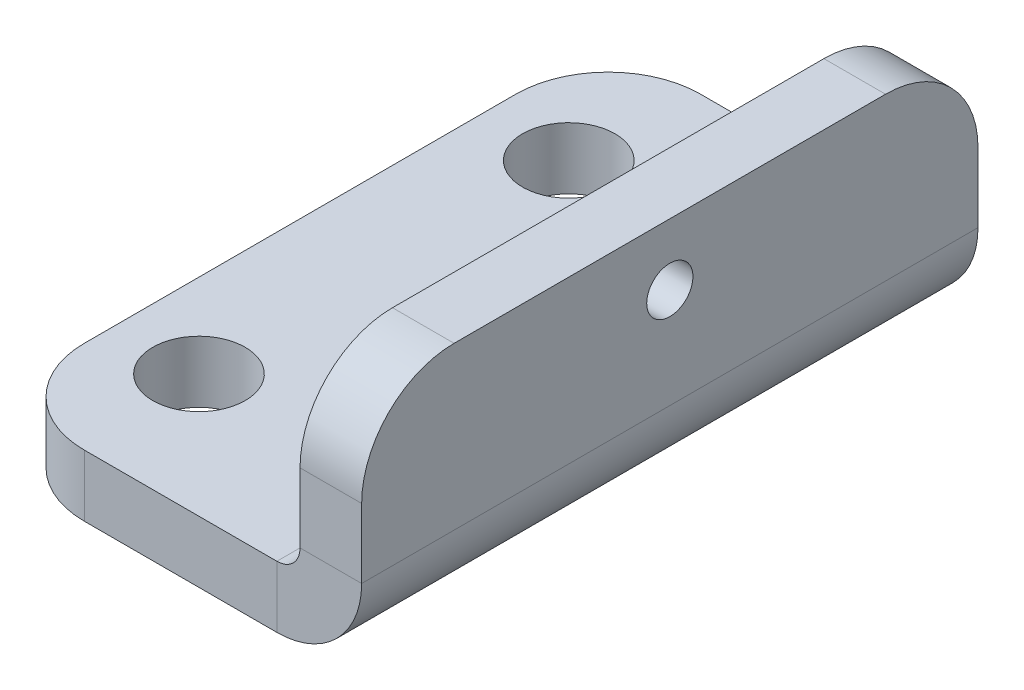
ISO-10303-21;
HEADER;
FILE_DESCRIPTION(('STEP AP214'),'2;1');
FILE_NAME('part.step','',(''),(''),'','','');
FILE_SCHEMA(('AUTOMOTIVE_DESIGN { 1 0 10303 214 1 1 1 1 }'));
ENDSEC;
DATA;
#1=APPLICATION_CONTEXT('core data for automotive mechanical design processes');
#2=APPLICATION_PROTOCOL_DEFINITION('international standard','automotive_design',2000,#1);
#3=PRODUCT_CONTEXT('',#1,'mechanical');
#4=PRODUCT('Part','Part','',(#3));
#5=PRODUCT_RELATED_PRODUCT_CATEGORY('part','',(#4));
#6=PRODUCT_DEFINITION_FORMATION('','',#4);
#7=PRODUCT_DEFINITION_CONTEXT('part definition',#1,'design');
#8=PRODUCT_DEFINITION('design','',#6,#7);
#9=PRODUCT_DEFINITION_SHAPE('','',#8);
#10=(LENGTH_UNIT() NAMED_UNIT(*) SI_UNIT(.MILLI.,.METRE.));
#11=(NAMED_UNIT(*) PLANE_ANGLE_UNIT() SI_UNIT($,.RADIAN.));
#12=(NAMED_UNIT(*) SI_UNIT($,.STERADIAN.) SOLID_ANGLE_UNIT());
#13=UNCERTAINTY_MEASURE_WITH_UNIT(LENGTH_MEASURE(1.E-05),#10,'distance_accuracy_value','');
#14=(GEOMETRIC_REPRESENTATION_CONTEXT(3) GLOBAL_UNCERTAINTY_ASSIGNED_CONTEXT((#13)) GLOBAL_UNIT_ASSIGNED_CONTEXT((#10,
#11,#12)) REPRESENTATION_CONTEXT('',''));
#15=CARTESIAN_POINT('',(0.,0.,0.));
#16=DIRECTION('',(0.,0.,1.));
#17=DIRECTION('',(1.,0.,0.));
#18=AXIS2_PLACEMENT_3D('',#15,#16,#17);
#19=CARTESIAN_POINT('',(-2.75,0.,10.));
#20=DIRECTION('',(0.,0.,1.));
#21=DIRECTION('',(1.,0.,0.));
#22=AXIS2_PLACEMENT_3D('',#19,#20,#21);
#23=PLANE('',#22);
#24=DIRECTION('',(0.,1.,0.));
#25=VECTOR('',#24,1.);
#26=CARTESIAN_POINT('',(-2.75,0.,10.));
#27=LINE('',#26,#25);
#28=CARTESIAN_POINT('',(-2.75,0.,10.));
#29=VERTEX_POINT('',#28);
#30=CARTESIAN_POINT('',(-2.75,2.,10.));
#31=VERTEX_POINT('',#30);
#32=EDGE_CURVE('E135',#29,#31,#27,.T.);
#33=ORIENTED_EDGE('',*,*,#32,.F.);
#34=CARTESIAN_POINT('',(-2.75,2.75,10.));
#35=DIRECTION('',(0.,0.,1.));
#36=DIRECTION('',(1.,0.,0.));
#37=AXIS2_PLACEMENT_3D('',#34,#35,#36);
#38=CIRCLE('',#37,2.75);
#39=CARTESIAN_POINT('',(0.,2.75,10.));
#40=VERTEX_POINT('',#39);
#41=EDGE_CURVE('E139',#40,#29,#38,.F.);
#42=ORIENTED_EDGE('',*,*,#41,.F.);
#43=DIRECTION('',(1.,0.,0.));
#44=VECTOR('',#43,1.);
#45=CARTESIAN_POINT('',(-2.,2.75,10.));
#46=LINE('',#45,#44);
#47=CARTESIAN_POINT('',(-2.,2.75,10.));
#48=VERTEX_POINT('',#47);
#49=EDGE_CURVE('E145',#48,#40,#46,.T.);
#50=ORIENTED_EDGE('',*,*,#49,.F.);
#51=CARTESIAN_POINT('',(-2.75,2.75,10.));
#52=DIRECTION('',(0.,0.,1.));
#53=DIRECTION('',(1.,0.,0.));
#54=AXIS2_PLACEMENT_3D('',#51,#52,#53);
#55=CIRCLE('',#54,0.75);
#56=EDGE_CURVE('E141',#48,#31,#55,.F.);
#57=ORIENTED_EDGE('',*,*,#56,.T.);
#58=EDGE_LOOP('',(#33,#42,#50,#57));
#59=FACE_BOUND('',#58,.T.);
#60=ADVANCED_FACE('F43',(#59),#23,.T.);
#61=CARTESIAN_POINT('',(-2.,2.75,10.));
#62=DIRECTION('',(0.,0.,1.));
#63=DIRECTION('',(1.,0.,0.));
#64=AXIS2_PLACEMENT_3D('',#61,#62,#63);
#65=PLANE('',#64);
#66=DIRECTION('',(-1.,0.,0.));
#67=VECTOR('',#66,1.);
#68=CARTESIAN_POINT('',(0.,2.,10.));
#69=LINE('',#68,#67);
#70=CARTESIAN_POINT('',(-9.,2.,10.));
#71=VERTEX_POINT('',#70);
#72=EDGE_CURVE('E165',#31,#71,#69,.T.);
#73=ORIENTED_EDGE('',*,*,#72,.T.);
#74=DIRECTION('',(0.,1.,0.));
#75=VECTOR('',#74,1.);
#76=CARTESIAN_POINT('',(-9.,2.75,10.));
#77=LINE('',#76,#75);
#78=CARTESIAN_POINT('',(-9.,0.,10.));
#79=VERTEX_POINT('',#78);
#80=EDGE_CURVE('E52',#71,#79,#77,.F.);
#81=ORIENTED_EDGE('',*,*,#80,.T.);
#82=DIRECTION('',(-1.,0.,0.));
#83=VECTOR('',#82,1.);
#84=CARTESIAN_POINT('',(0.,0.,10.));
#85=LINE('',#84,#83);
#86=EDGE_CURVE('E152',#29,#79,#85,.T.);
#87=ORIENTED_EDGE('',*,*,#86,.F.);
#88=ORIENTED_EDGE('',*,*,#32,.T.);
#89=EDGE_LOOP('',(#73,#81,#87,#88));
#90=FACE_BOUND('',#89,.T.);
#91=ADVANCED_FACE('F163',(#90),#65,.T.);
#92=CARTESIAN_POINT('',(0.,2.75,-10.));
#93=DIRECTION('',(0.,0.,-1.));
#94=DIRECTION('',(-1.,0.,0.));
#95=AXIS2_PLACEMENT_3D('',#92,#93,#94);
#96=PLANE('',#95);
#97=DIRECTION('',(-1.,0.,0.));
#98=VECTOR('',#97,1.);
#99=CARTESIAN_POINT('',(0.,2.75,-10.));
#100=LINE('',#99,#98);
#101=CARTESIAN_POINT('',(0.,2.75,-10.));
#102=VERTEX_POINT('',#101);
#103=CARTESIAN_POINT('',(-2.,2.75,-10.));
#104=VERTEX_POINT('',#103);
#105=EDGE_CURVE('E228',#102,#104,#100,.T.);
#106=ORIENTED_EDGE('',*,*,#105,.F.);
#107=CARTESIAN_POINT('',(-2.75,2.75,-10.));
#108=DIRECTION('',(0.,0.,1.));
#109=DIRECTION('',(1.,0.,0.));
#110=AXIS2_PLACEMENT_3D('',#107,#108,#109);
#111=CIRCLE('',#110,2.75);
#112=CARTESIAN_POINT('',(-2.75,0.,-10.));
#113=VERTEX_POINT('',#112);
#114=EDGE_CURVE('E190',#102,#113,#111,.F.);
#115=ORIENTED_EDGE('',*,*,#114,.T.);
#116=DIRECTION('',(0.,-1.,0.));
#117=VECTOR('',#116,1.);
#118=CARTESIAN_POINT('',(-2.75,2.,-10.));
#119=LINE('',#118,#117);
#120=CARTESIAN_POINT('',(-2.75,2.,-10.));
#121=VERTEX_POINT('',#120);
#122=EDGE_CURVE('E225',#121,#113,#119,.T.);
#123=ORIENTED_EDGE('',*,*,#122,.F.);
#124=CARTESIAN_POINT('',(-2.75,2.75,-10.));
#125=DIRECTION('',(0.,0.,1.));
#126=DIRECTION('',(1.,0.,0.));
#127=AXIS2_PLACEMENT_3D('',#124,#125,#126);
#128=CIRCLE('',#127,0.75);
#129=EDGE_CURVE('E199',#104,#121,#128,.F.);
#130=ORIENTED_EDGE('',*,*,#129,.F.);
#131=EDGE_LOOP('',(#106,#115,#123,#130));
#132=FACE_BOUND('',#131,.T.);
#133=ADVANCED_FACE('F354',(#132),#96,.T.);
#134=CARTESIAN_POINT('',(-2.75,2.,-10.));
#135=DIRECTION('',(0.,0.,-1.));
#136=DIRECTION('',(-1.,0.,0.));
#137=AXIS2_PLACEMENT_3D('',#134,#135,#136);
#138=PLANE('',#137);
#139=DIRECTION('',(0.,1.,0.));
#140=VECTOR('',#139,1.);
#141=CARTESIAN_POINT('',(-2.,8.,-10.));
#142=LINE('',#141,#140);
#143=CARTESIAN_POINT('',(-2.,5.,-10.));
#144=VERTEX_POINT('',#143);
#145=EDGE_CURVE('E196',#144,#104,#142,.F.);
#146=ORIENTED_EDGE('',*,*,#145,.F.);
#147=DIRECTION('',(1.,0.,0.));
#148=VECTOR('',#147,1.);
#149=CARTESIAN_POINT('',(-2.75,5.,-10.));
#150=LINE('',#149,#148);
#151=CARTESIAN_POINT('',(0.,5.,-10.));
#152=VERTEX_POINT('',#151);
#153=EDGE_CURVE('E144',#144,#152,#150,.T.);
#154=ORIENTED_EDGE('',*,*,#153,.T.);
#155=DIRECTION('',(0.,-1.,0.));
#156=VECTOR('',#155,1.);
#157=CARTESIAN_POINT('',(0.,8.,-10.));
#158=LINE('',#157,#156);
#159=EDGE_CURVE('E193',#152,#102,#158,.T.);
#160=ORIENTED_EDGE('',*,*,#159,.T.);
#161=ORIENTED_EDGE('',*,*,#105,.T.);
#162=EDGE_LOOP('',(#146,#154,#160,#161));
#163=FACE_BOUND('',#162,.T.);
#164=ADVANCED_FACE('F349',(#163),#138,.T.);
#165=CARTESIAN_POINT('',(0.,2.,10.));
#166=DIRECTION('',(0.,-1.,0.));
#167=DIRECTION('',(1.,0.,0.));
#168=AXIS2_PLACEMENT_3D('',#165,#166,#167);
#169=PLANE('',#168);
#170=CARTESIAN_POINT('',(-9.27896890843565,2.,6.));
#171=DIRECTION('',(0.,1.,0.));
#172=DIRECTION('',(1.,0.,0.));
#173=AXIS2_PLACEMENT_3D('',#170,#171,#172);
#174=CIRCLE('',#173,1.5);
#175=CARTESIAN_POINT('',(-7.77896890843565,2.,6.));
#176=VERTEX_POINT('',#175);
#177=EDGE_CURVE('E304',#176,#176,#174,.T.);
#178=ORIENTED_EDGE('',*,*,#177,.F.);
#179=EDGE_LOOP('',(#178));
#180=FACE_BOUND('',#179,.T.);
#181=CARTESIAN_POINT('',(-9.27896890843565,2.,-6.));
#182=DIRECTION('',(0.,1.,0.));
#183=DIRECTION('',(-1.,0.,0.));
#184=AXIS2_PLACEMENT_3D('',#181,#182,#183);
#185=CIRCLE('',#184,1.5);
#186=CARTESIAN_POINT('',(-10.7789689084356,2.,-6.));
#187=VERTEX_POINT('',#186);
#188=EDGE_CURVE('E296',#187,#187,#185,.T.);
#189=ORIENTED_EDGE('',*,*,#188,.F.);
#190=EDGE_LOOP('',(#189));
#191=FACE_BOUND('',#190,.T.);
#192=DIRECTION('',(-1.,0.,0.));
#193=VECTOR('',#192,1.);
#194=CARTESIAN_POINT('',(0.,2.,-10.));
#195=LINE('',#194,#193);
#196=CARTESIAN_POINT('',(-9.,2.,-10.));
#197=VERTEX_POINT('',#196);
#198=EDGE_CURVE('E183',#121,#197,#195,.T.);
#199=ORIENTED_EDGE('',*,*,#198,.T.);
#200=CARTESIAN_POINT('',(-9.,2.,-7.));
#201=DIRECTION('',(0.,-1.,0.));
#202=DIRECTION('',(1.,0.,0.));
#203=AXIS2_PLACEMENT_3D('',#200,#201,#202);
#204=CIRCLE('',#203,3.);
#205=CARTESIAN_POINT('',(-12.,2.,-7.));
#206=VERTEX_POINT('',#205);
#207=EDGE_CURVE('E264',#197,#206,#204,.F.);
#208=ORIENTED_EDGE('',*,*,#207,.T.);
#209=DIRECTION('',(0.,0.,-1.));
#210=VECTOR('',#209,1.);
#211=CARTESIAN_POINT('',(-12.,2.,10.));
#212=LINE('',#211,#210);
#213=CARTESIAN_POINT('',(-12.,2.,7.));
#214=VERTEX_POINT('',#213);
#215=EDGE_CURVE('E222',#214,#206,#212,.T.);
#216=ORIENTED_EDGE('',*,*,#215,.F.);
#217=CARTESIAN_POINT('',(-9.,2.,7.));
#218=DIRECTION('',(0.,-1.,0.));
#219=DIRECTION('',(1.,0.,0.));
#220=AXIS2_PLACEMENT_3D('',#217,#218,#219);
#221=CIRCLE('',#220,3.);
#222=EDGE_CURVE('E261',#214,#71,#221,.F.);
#223=ORIENTED_EDGE('',*,*,#222,.T.);
#224=ORIENTED_EDGE('',*,*,#72,.F.);
#225=DIRECTION('',(0.,0.,-1.));
#226=VECTOR('',#225,1.);
#227=CARTESIAN_POINT('',(-2.75,2.,10.));
#228=LINE('',#227,#226);
#229=EDGE_CURVE('E182',#31,#121,#228,.T.);
#230=ORIENTED_EDGE('',*,*,#229,.T.);
#231=EDGE_LOOP('',(#199,#208,#216,#223,#224,#230));
#232=FACE_BOUND('',#231,.T.);
#233=ADVANCED_FACE('F288',(#180,#191,#232),#169,.F.);
#234=CARTESIAN_POINT('',(-12.,0.,10.));
#235=DIRECTION('',(-1.,0.,0.));
#236=DIRECTION('',(0.,0.,1.));
#237=AXIS2_PLACEMENT_3D('',#234,#235,#236);
#238=PLANE('',#237);
#239=ORIENTED_EDGE('',*,*,#215,.T.);
#240=DIRECTION('',(0.,1.,0.));
#241=VECTOR('',#240,1.);
#242=CARTESIAN_POINT('',(-12.,0.,-7.));
#243=LINE('',#242,#241);
#244=CARTESIAN_POINT('',(-12.,0.,-7.));
#245=VERTEX_POINT('',#244);
#246=EDGE_CURVE('E66',#206,#245,#243,.F.);
#247=ORIENTED_EDGE('',*,*,#246,.T.);
#248=DIRECTION('',(0.,0.,-1.));
#249=VECTOR('',#248,1.);
#250=CARTESIAN_POINT('',(-12.,0.,10.));
#251=LINE('',#250,#249);
#252=CARTESIAN_POINT('',(-12.,0.,7.));
#253=VERTEX_POINT('',#252);
#254=EDGE_CURVE('E160',#253,#245,#251,.T.);
#255=ORIENTED_EDGE('',*,*,#254,.F.);
#256=DIRECTION('',(0.,1.,0.));
#257=VECTOR('',#256,1.);
#258=CARTESIAN_POINT('',(-12.,0.,7.));
#259=LINE('',#258,#257);
#260=EDGE_CURVE('E267',#253,#214,#259,.T.);
#261=ORIENTED_EDGE('',*,*,#260,.T.);
#262=EDGE_LOOP('',(#239,#247,#255,#261));
#263=FACE_BOUND('',#262,.T.);
#264=ADVANCED_FACE('F289',(#263),#238,.T.);
#265=CARTESIAN_POINT('',(0.,0.,10.));
#266=DIRECTION('',(0.,-1.,0.));
#267=DIRECTION('',(1.,0.,0.));
#268=AXIS2_PLACEMENT_3D('',#265,#266,#267);
#269=PLANE('',#268);
#270=CARTESIAN_POINT('',(-9.27896890843565,0.,6.));
#271=DIRECTION('',(0.,1.,0.));
#272=DIRECTION('',(1.,0.,0.));
#273=AXIS2_PLACEMENT_3D('',#270,#271,#272);
#274=CIRCLE('',#273,1.5);
#275=CARTESIAN_POINT('',(-7.77896890843565,0.,6.));
#276=VERTEX_POINT('',#275);
#277=EDGE_CURVE('E300',#276,#276,#274,.T.);
#278=ORIENTED_EDGE('',*,*,#277,.T.);
#279=EDGE_LOOP('',(#278));
#280=FACE_BOUND('',#279,.T.);
#281=CARTESIAN_POINT('',(-9.27896890843565,0.,-6.));
#282=DIRECTION('',(0.,1.,0.));
#283=DIRECTION('',(-1.,0.,0.));
#284=AXIS2_PLACEMENT_3D('',#281,#282,#283);
#285=CIRCLE('',#284,1.5);
#286=CARTESIAN_POINT('',(-10.7789689084356,0.,-6.));
#287=VERTEX_POINT('',#286);
#288=EDGE_CURVE('E187',#287,#287,#285,.T.);
#289=ORIENTED_EDGE('',*,*,#288,.T.);
#290=EDGE_LOOP('',(#289));
#291=FACE_BOUND('',#290,.T.);
#292=ORIENTED_EDGE('',*,*,#254,.T.);
#293=CARTESIAN_POINT('',(-9.,0.,-7.));
#294=DIRECTION('',(0.,-1.,0.));
#295=DIRECTION('',(1.,0.,0.));
#296=AXIS2_PLACEMENT_3D('',#293,#294,#295);
#297=CIRCLE('',#296,3.);
#298=CARTESIAN_POINT('',(-9.,0.,-10.));
#299=VERTEX_POINT('',#298);
#300=EDGE_CURVE('E276',#245,#299,#297,.T.);
#301=ORIENTED_EDGE('',*,*,#300,.T.);
#302=DIRECTION('',(-1.,0.,0.));
#303=VECTOR('',#302,1.);
#304=CARTESIAN_POINT('',(0.,0.,-10.));
#305=LINE('',#304,#303);
#306=EDGE_CURVE('E155',#113,#299,#305,.T.);
#307=ORIENTED_EDGE('',*,*,#306,.F.);
#308=DIRECTION('',(0.,0.,-1.));
#309=VECTOR('',#308,1.);
#310=CARTESIAN_POINT('',(-2.75,0.,10.));
#311=LINE('',#310,#309);
#312=EDGE_CURVE('E150',#29,#113,#311,.T.);
#313=ORIENTED_EDGE('',*,*,#312,.F.);
#314=ORIENTED_EDGE('',*,*,#86,.T.);
#315=CARTESIAN_POINT('',(-9.,0.,7.));
#316=DIRECTION('',(0.,-1.,0.));
#317=DIRECTION('',(1.,0.,0.));
#318=AXIS2_PLACEMENT_3D('',#315,#316,#317);
#319=CIRCLE('',#318,3.);
#320=EDGE_CURVE('E273',#79,#253,#319,.T.);
#321=ORIENTED_EDGE('',*,*,#320,.T.);
#322=EDGE_LOOP('',(#292,#301,#307,#313,#314,#321));
#323=FACE_BOUND('',#322,.T.);
#324=ADVANCED_FACE('F151',(#280,#291,#323),#269,.T.);
#325=CARTESIAN_POINT('',(-2.75,2.75,10.));
#326=DIRECTION('',(0.,0.,-1.));
#327=DIRECTION('',(-1.,0.,0.));
#328=AXIS2_PLACEMENT_3D('',#325,#326,#327);
#329=CYLINDRICAL_SURFACE('',#328,2.75);
#330=ORIENTED_EDGE('',*,*,#114,.F.);
#331=DIRECTION('',(0.,0.,-1.));
#332=VECTOR('',#331,1.);
#333=CARTESIAN_POINT('',(0.,2.75,10.));
#334=LINE('',#333,#332);
#335=EDGE_CURVE('E161',#40,#102,#334,.T.);
#336=ORIENTED_EDGE('',*,*,#335,.F.);
#337=ORIENTED_EDGE('',*,*,#41,.T.);
#338=ORIENTED_EDGE('',*,*,#312,.T.);
#339=EDGE_LOOP('',(#330,#336,#337,#338));
#340=FACE_BOUND('',#339,.T.);
#341=ADVANCED_FACE('F168',(#340),#329,.T.);
#342=CARTESIAN_POINT('',(0.,8.,10.));
#343=DIRECTION('',(1.,0.,0.));
#344=DIRECTION('',(0.,0.,-1.));
#345=AXIS2_PLACEMENT_3D('',#342,#343,#344);
#346=PLANE('',#345);
#347=CARTESIAN_POINT('',(0.,6.,0.));
#348=DIRECTION('',(-1.,0.,0.));
#349=DIRECTION('',(0.,0.,1.));
#350=AXIS2_PLACEMENT_3D('',#347,#348,#349);
#351=CIRCLE('',#350,0.75);
#352=CARTESIAN_POINT('',(0.,6.,0.75));
#353=VERTEX_POINT('',#352);
#354=EDGE_CURVE('E308',#353,#353,#351,.T.);
#355=ORIENTED_EDGE('',*,*,#354,.T.);
#356=EDGE_LOOP('',(#355));
#357=FACE_BOUND('',#356,.T.);
#358=ORIENTED_EDGE('',*,*,#159,.F.);
#359=CARTESIAN_POINT('',(0.,5.,-7.));
#360=DIRECTION('',(1.,0.,0.));
#361=DIRECTION('',(0.,0.,-1.));
#362=AXIS2_PLACEMENT_3D('',#359,#360,#361);
#363=CIRCLE('',#362,3.);
#364=CARTESIAN_POINT('',(0.,8.,-7.));
#365=VERTEX_POINT('',#364);
#366=EDGE_CURVE('E241',#152,#365,#363,.T.);
#367=ORIENTED_EDGE('',*,*,#366,.T.);
#368=DIRECTION('',(0.,0.,-1.));
#369=VECTOR('',#368,1.);
#370=CARTESIAN_POINT('',(0.,8.,10.));
#371=LINE('',#370,#369);
#372=CARTESIAN_POINT('',(0.,8.,7.));
#373=VERTEX_POINT('',#372);
#374=EDGE_CURVE('E214',#373,#365,#371,.T.);
#375=ORIENTED_EDGE('',*,*,#374,.F.);
#376=CARTESIAN_POINT('',(0.,5.,7.));
#377=DIRECTION('',(1.,0.,0.));
#378=DIRECTION('',(0.,0.,-1.));
#379=AXIS2_PLACEMENT_3D('',#376,#377,#378);
#380=CIRCLE('',#379,3.);
#381=CARTESIAN_POINT('',(0.,5.,10.));
#382=VERTEX_POINT('',#381);
#383=EDGE_CURVE('E238',#373,#382,#380,.T.);
#384=ORIENTED_EDGE('',*,*,#383,.T.);
#385=DIRECTION('',(0.,-1.,0.));
#386=VECTOR('',#385,1.);
#387=CARTESIAN_POINT('',(0.,8.,10.));
#388=LINE('',#387,#386);
#389=EDGE_CURVE('E171',#382,#40,#388,.T.);
#390=ORIENTED_EDGE('',*,*,#389,.T.);
#391=ORIENTED_EDGE('',*,*,#335,.T.);
#392=EDGE_LOOP('',(#358,#367,#375,#384,#390,#391));
#393=FACE_BOUND('',#392,.T.);
#394=ADVANCED_FACE('F320',(#357,#393),#346,.T.);
#395=CARTESIAN_POINT('',(-2.,8.,10.));
#396=DIRECTION('',(0.,1.,0.));
#397=DIRECTION('',(0.,0.,1.));
#398=AXIS2_PLACEMENT_3D('',#395,#396,#397);
#399=PLANE('',#398);
#400=ORIENTED_EDGE('',*,*,#374,.T.);
#401=DIRECTION('',(1.,0.,0.));
#402=VECTOR('',#401,1.);
#403=CARTESIAN_POINT('',(-2.,8.,-7.));
#404=LINE('',#403,#402);
#405=CARTESIAN_POINT('',(-2.,8.,-7.));
#406=VERTEX_POINT('',#405);
#407=EDGE_CURVE('E248',#365,#406,#404,.F.);
#408=ORIENTED_EDGE('',*,*,#407,.T.);
#409=DIRECTION('',(0.,0.,-1.));
#410=VECTOR('',#409,1.);
#411=CARTESIAN_POINT('',(-2.,8.,10.));
#412=LINE('',#411,#410);
#413=CARTESIAN_POINT('',(-2.,8.,7.));
#414=VERTEX_POINT('',#413);
#415=EDGE_CURVE('E210',#414,#406,#412,.T.);
#416=ORIENTED_EDGE('',*,*,#415,.F.);
#417=DIRECTION('',(1.,0.,0.));
#418=VECTOR('',#417,1.);
#419=CARTESIAN_POINT('',(-2.,8.,7.));
#420=LINE('',#419,#418);
#421=EDGE_CURVE('E244',#414,#373,#420,.T.);
#422=ORIENTED_EDGE('',*,*,#421,.T.);
#423=EDGE_LOOP('',(#400,#408,#416,#422));
#424=FACE_BOUND('',#423,.T.);
#425=ADVANCED_FACE('F334',(#424),#399,.T.);
#426=CARTESIAN_POINT('',(-2.,8.,10.));
#427=DIRECTION('',(1.,0.,0.));
#428=DIRECTION('',(0.,0.,-1.));
#429=AXIS2_PLACEMENT_3D('',#426,#427,#428);
#430=PLANE('',#429);
#431=CARTESIAN_POINT('',(-2.,6.,0.));
#432=DIRECTION('',(-1.,0.,0.));
#433=DIRECTION('',(0.,0.,1.));
#434=AXIS2_PLACEMENT_3D('',#431,#432,#433);
#435=CIRCLE('',#434,0.75);
#436=CARTESIAN_POINT('',(-2.,6.,0.75));
#437=VERTEX_POINT('',#436);
#438=EDGE_CURVE('E312',#437,#437,#435,.T.);
#439=ORIENTED_EDGE('',*,*,#438,.F.);
#440=EDGE_LOOP('',(#439));
#441=FACE_BOUND('',#440,.T.);
#442=ORIENTED_EDGE('',*,*,#415,.T.);
#443=CARTESIAN_POINT('',(-2.,5.,-7.));
#444=DIRECTION('',(1.,0.,0.));
#445=DIRECTION('',(0.,0.,-1.));
#446=AXIS2_PLACEMENT_3D('',#443,#444,#445);
#447=CIRCLE('',#446,3.);
#448=EDGE_CURVE('E254',#406,#144,#447,.F.);
#449=ORIENTED_EDGE('',*,*,#448,.T.);
#450=ORIENTED_EDGE('',*,*,#145,.T.);
#451=DIRECTION('',(0.,0.,-1.));
#452=VECTOR('',#451,1.);
#453=CARTESIAN_POINT('',(-2.,2.75,10.));
#454=LINE('',#453,#452);
#455=EDGE_CURVE('E206',#48,#104,#454,.T.);
#456=ORIENTED_EDGE('',*,*,#455,.F.);
#457=DIRECTION('',(0.,1.,0.));
#458=VECTOR('',#457,1.);
#459=CARTESIAN_POINT('',(-2.,8.,10.));
#460=LINE('',#459,#458);
#461=CARTESIAN_POINT('',(-2.,5.,10.));
#462=VERTEX_POINT('',#461);
#463=EDGE_CURVE('E174',#462,#48,#460,.F.);
#464=ORIENTED_EDGE('',*,*,#463,.F.);
#465=CARTESIAN_POINT('',(-2.,5.,7.));
#466=DIRECTION('',(1.,0.,0.));
#467=DIRECTION('',(0.,0.,-1.));
#468=AXIS2_PLACEMENT_3D('',#465,#466,#467);
#469=CIRCLE('',#468,3.);
#470=EDGE_CURVE('E251',#462,#414,#469,.F.);
#471=ORIENTED_EDGE('',*,*,#470,.T.);
#472=EDGE_LOOP('',(#442,#449,#450,#456,#464,#471));
#473=FACE_BOUND('',#472,.T.);
#474=ADVANCED_FACE('F330',(#441,#473),#430,.F.);
#475=CARTESIAN_POINT('',(-2.75,2.75,10.));
#476=DIRECTION('',(0.,0.,-1.));
#477=DIRECTION('',(-1.,0.,0.));
#478=AXIS2_PLACEMENT_3D('',#475,#476,#477);
#479=CYLINDRICAL_SURFACE('',#478,0.75);
#480=ORIENTED_EDGE('',*,*,#129,.T.);
#481=ORIENTED_EDGE('',*,*,#229,.F.);
#482=ORIENTED_EDGE('',*,*,#56,.F.);
#483=ORIENTED_EDGE('',*,*,#455,.T.);
#484=EDGE_LOOP('',(#480,#481,#482,#483));
#485=FACE_BOUND('',#484,.T.);
#486=ADVANCED_FACE('F333',(#485),#479,.F.);
#487=CARTESIAN_POINT('',(-2.75,2.75,10.));
#488=DIRECTION('',(0.,0.,1.));
#489=DIRECTION('',(1.,0.,0.));
#490=AXIS2_PLACEMENT_3D('',#487,#488,#489);
#491=PLANE('',#490);
#492=ORIENTED_EDGE('',*,*,#389,.F.);
#493=DIRECTION('',(1.,0.,0.));
#494=VECTOR('',#493,1.);
#495=CARTESIAN_POINT('',(-2.75,5.,10.));
#496=LINE('',#495,#494);
#497=EDGE_CURVE('E11',#382,#462,#496,.F.);
#498=ORIENTED_EDGE('',*,*,#497,.T.);
#499=ORIENTED_EDGE('',*,*,#463,.T.);
#500=ORIENTED_EDGE('',*,*,#49,.T.);
#501=EDGE_LOOP('',(#492,#498,#499,#500));
#502=FACE_BOUND('',#501,.T.);
#503=ADVANCED_FACE('F361',(#502),#491,.T.);
#504=CARTESIAN_POINT('',(-2.75,2.75,-10.));
#505=DIRECTION('',(0.,0.,1.));
#506=DIRECTION('',(1.,0.,0.));
#507=AXIS2_PLACEMENT_3D('',#504,#505,#506);
#508=PLANE('',#507);
#509=ORIENTED_EDGE('',*,*,#306,.T.);
#510=DIRECTION('',(0.,1.,0.));
#511=VECTOR('',#510,1.);
#512=CARTESIAN_POINT('',(-9.,2.,-10.));
#513=LINE('',#512,#511);
#514=EDGE_CURVE('E257',#299,#197,#513,.T.);
#515=ORIENTED_EDGE('',*,*,#514,.T.);
#516=ORIENTED_EDGE('',*,*,#198,.F.);
#517=ORIENTED_EDGE('',*,*,#122,.T.);
#518=EDGE_LOOP('',(#509,#515,#516,#517));
#519=FACE_BOUND('',#518,.T.);
#520=ADVANCED_FACE('F283',(#519),#508,.F.);
#521=CARTESIAN_POINT('',(-2.75,5.,-7.));
#522=DIRECTION('',(1.,0.,0.));
#523=DIRECTION('',(0.,0.,-1.));
#524=AXIS2_PLACEMENT_3D('',#521,#522,#523);
#525=CYLINDRICAL_SURFACE('',#524,3.);
#526=ORIENTED_EDGE('',*,*,#448,.F.);
#527=ORIENTED_EDGE('',*,*,#407,.F.);
#528=ORIENTED_EDGE('',*,*,#366,.F.);
#529=ORIENTED_EDGE('',*,*,#153,.F.);
#530=EDGE_LOOP('',(#526,#527,#528,#529));
#531=FACE_BOUND('',#530,.T.);
#532=ADVANCED_FACE('F346',(#531),#525,.T.);
#533=CARTESIAN_POINT('',(-9.,2.75,-7.));
#534=DIRECTION('',(0.,-1.,0.));
#535=DIRECTION('',(0.,0.,-1.));
#536=AXIS2_PLACEMENT_3D('',#533,#534,#535);
#537=CYLINDRICAL_SURFACE('',#536,3.);
#538=ORIENTED_EDGE('',*,*,#300,.F.);
#539=ORIENTED_EDGE('',*,*,#246,.F.);
#540=ORIENTED_EDGE('',*,*,#207,.F.);
#541=ORIENTED_EDGE('',*,*,#514,.F.);
#542=EDGE_LOOP('',(#538,#539,#540,#541));
#543=FACE_BOUND('',#542,.T.);
#544=ADVANCED_FACE('F285',(#543),#537,.T.);
#545=CARTESIAN_POINT('',(-9.,0.,7.));
#546=DIRECTION('',(0.,1.,0.));
#547=DIRECTION('',(0.,0.,1.));
#548=AXIS2_PLACEMENT_3D('',#545,#546,#547);
#549=CYLINDRICAL_SURFACE('',#548,3.);
#550=ORIENTED_EDGE('',*,*,#320,.F.);
#551=ORIENTED_EDGE('',*,*,#80,.F.);
#552=ORIENTED_EDGE('',*,*,#222,.F.);
#553=ORIENTED_EDGE('',*,*,#260,.F.);
#554=EDGE_LOOP('',(#550,#551,#552,#553));
#555=FACE_BOUND('',#554,.T.);
#556=ADVANCED_FACE('F292',(#555),#549,.T.);
#557=CARTESIAN_POINT('',(-2.,5.,7.));
#558=DIRECTION('',(1.,0.,0.));
#559=DIRECTION('',(0.,0.,-1.));
#560=AXIS2_PLACEMENT_3D('',#557,#558,#559);
#561=CYLINDRICAL_SURFACE('',#560,3.);
#562=ORIENTED_EDGE('',*,*,#470,.F.);
#563=ORIENTED_EDGE('',*,*,#497,.F.);
#564=ORIENTED_EDGE('',*,*,#383,.F.);
#565=ORIENTED_EDGE('',*,*,#421,.F.);
#566=EDGE_LOOP('',(#562,#563,#564,#565));
#567=FACE_BOUND('',#566,.T.);
#568=ADVANCED_FACE('F45',(#567),#561,.T.);
#569=CARTESIAN_POINT('',(-9.27896890843565,0.,-6.));
#570=DIRECTION('',(0.,1.,0.));
#571=DIRECTION('',(-1.,0.,0.));
#572=AXIS2_PLACEMENT_3D('',#569,#570,#571);
#573=CYLINDRICAL_SURFACE('',#572,1.5);
#574=ORIENTED_EDGE('',*,*,#288,.F.);
#575=EDGE_LOOP('',(#574));
#576=FACE_BOUND('',#575,.T.);
#577=ORIENTED_EDGE('',*,*,#188,.T.);
#578=EDGE_LOOP('',(#577));
#579=FACE_BOUND('',#578,.T.);
#580=ADVANCED_FACE('F386',(#576,#579),#573,.F.);
#581=CARTESIAN_POINT('',(-9.27896890843565,0.,6.));
#582=DIRECTION('',(0.,1.,0.));
#583=DIRECTION('',(-1.,0.,0.));
#584=AXIS2_PLACEMENT_3D('',#581,#582,#583);
#585=CYLINDRICAL_SURFACE('',#584,1.5);
#586=ORIENTED_EDGE('',*,*,#277,.F.);
#587=EDGE_LOOP('',(#586));
#588=FACE_BOUND('',#587,.T.);
#589=ORIENTED_EDGE('',*,*,#177,.T.);
#590=EDGE_LOOP('',(#589));
#591=FACE_BOUND('',#590,.T.);
#592=ADVANCED_FACE('F326',(#588,#591),#585,.F.);
#593=CARTESIAN_POINT('',(0.,6.,0.));
#594=DIRECTION('',(-1.,0.,0.));
#595=DIRECTION('',(0.,0.,1.));
#596=AXIS2_PLACEMENT_3D('',#593,#594,#595);
#597=CYLINDRICAL_SURFACE('',#596,0.75);
#598=ORIENTED_EDGE('',*,*,#354,.F.);
#599=EDGE_LOOP('',(#598));
#600=FACE_BOUND('',#599,.T.);
#601=ORIENTED_EDGE('',*,*,#438,.T.);
#602=EDGE_LOOP('',(#601));
#603=FACE_BOUND('',#602,.T.);
#604=ADVANCED_FACE('F323',(#600,#603),#597,.F.);
#605=CLOSED_SHELL('',(#60,#91,#133,#164,#233,#264,#324,#341,#394,#425,#474,#486,#503,#520,#532,
#544,#556,#568,#580,#592,#604));
#606=MANIFOLD_SOLID_BREP('B2',#605);
#607=ADVANCED_BREP_SHAPE_REPRESENTATION('',(#18,#606),#14);
#608=SHAPE_DEFINITION_REPRESENTATION(#9,#607);
ENDSEC;
END-ISO-10303-21;
